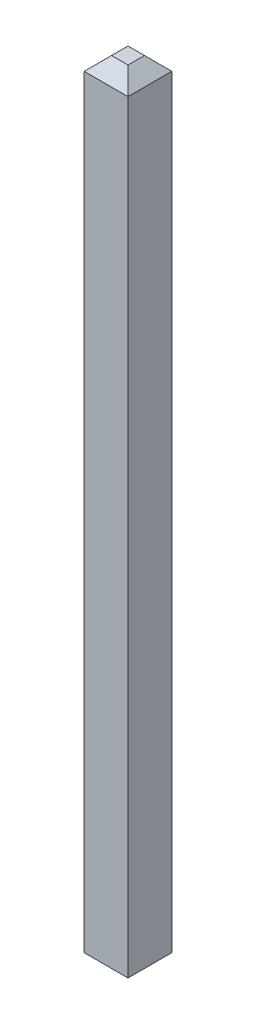
ISO-10303-21;
HEADER;
FILE_DESCRIPTION(('STEP AP214'),'2;1');
FILE_NAME('part.step','',(''),(''),'','','');
FILE_SCHEMA(('AUTOMOTIVE_DESIGN { 1 0 10303 214 1 1 1 1 }'));
ENDSEC;
DATA;
#1=APPLICATION_CONTEXT('core data for automotive mechanical design processes');
#2=APPLICATION_PROTOCOL_DEFINITION('international standard','automotive_design',2000,#1);
#3=PRODUCT_CONTEXT('',#1,'mechanical');
#4=PRODUCT('Part','Part','',(#3));
#5=PRODUCT_RELATED_PRODUCT_CATEGORY('part','',(#4));
#6=PRODUCT_DEFINITION_FORMATION('','',#4);
#7=PRODUCT_DEFINITION_CONTEXT('part definition',#1,'design');
#8=PRODUCT_DEFINITION('design','',#6,#7);
#9=PRODUCT_DEFINITION_SHAPE('','',#8);
#10=(LENGTH_UNIT() NAMED_UNIT(*) SI_UNIT(.MILLI.,.METRE.));
#11=(NAMED_UNIT(*) PLANE_ANGLE_UNIT() SI_UNIT($,.RADIAN.));
#12=(NAMED_UNIT(*) SI_UNIT($,.STERADIAN.) SOLID_ANGLE_UNIT());
#13=UNCERTAINTY_MEASURE_WITH_UNIT(LENGTH_MEASURE(1.E-05),#10,'distance_accuracy_value','');
#14=(GEOMETRIC_REPRESENTATION_CONTEXT(3) GLOBAL_UNCERTAINTY_ASSIGNED_CONTEXT((#13)) GLOBAL_UNIT_ASSIGNED_CONTEXT((#10,
#11,#12)) REPRESENTATION_CONTEXT('',''));
#15=CARTESIAN_POINT('',(0.,0.,0.));
#16=DIRECTION('',(0.,0.,1.));
#17=DIRECTION('',(1.,0.,0.));
#18=AXIS2_PLACEMENT_3D('',#15,#16,#17);
#19=CARTESIAN_POINT('',(4.13,7.07,-0.32));
#20=DIRECTION('',(-0.707106781186548,-0.707106781186548,0.));
#21=DIRECTION('',(-0.707106781186548,0.707106781186548,0.));
#22=AXIS2_PLACEMENT_3D('',#19,#20,#21);
#23=PLANE('',#22);
#24=DIRECTION('',(0.577350269189626,-0.577350269189626,0.577350269189626));
#25=VECTOR('',#24,1.);
#26=CARTESIAN_POINT('',(3.916666666667,7.283333333333,0.106666666667));
#27=LINE('',#26,#25);
#28=CARTESIAN_POINT('',(3.93,7.27,0.12));
#29=VERTEX_POINT('',#28);
#30=CARTESIAN_POINT('',(4.13,7.07,0.32));
#31=VERTEX_POINT('',#30);
#32=EDGE_CURVE('E152',#29,#31,#27,.T.);
#33=ORIENTED_EDGE('',*,*,#32,.T.);
#34=DIRECTION('',(0.,0.,1.));
#35=VECTOR('',#34,1.);
#36=CARTESIAN_POINT('',(4.13,7.07,-0.32));
#37=LINE('',#36,#35);
#38=CARTESIAN_POINT('',(4.13,7.07,-0.32));
#39=VERTEX_POINT('',#38);
#40=EDGE_CURVE('E198',#39,#31,#37,.T.);
#41=ORIENTED_EDGE('',*,*,#40,.F.);
#42=DIRECTION('',(0.577350269189626,-0.577350269189626,-0.577350269189626));
#43=VECTOR('',#42,1.);
#44=CARTESIAN_POINT('',(4.13,7.07,-0.32));
#45=LINE('',#44,#43);
#46=CARTESIAN_POINT('',(3.93,7.27,-0.12));
#47=VERTEX_POINT('',#46);
#48=EDGE_CURVE('E11',#47,#39,#45,.T.);
#49=ORIENTED_EDGE('',*,*,#48,.F.);
#50=DIRECTION('',(0.,0.,-1.));
#51=VECTOR('',#50,1.);
#52=CARTESIAN_POINT('',(3.93,7.27,-0.32));
#53=LINE('',#52,#51);
#54=EDGE_CURVE('E163',#29,#47,#53,.T.);
#55=ORIENTED_EDGE('',*,*,#54,.F.);
#56=EDGE_LOOP('',(#33,#41,#49,#55));
#57=FACE_BOUND('',#56,.T.);
#58=ADVANCED_FACE('F17',(#57),#23,.F.);
#59=CARTESIAN_POINT('',(3.81,7.07,-0.32));
#60=DIRECTION('',(0.,0.707106781186548,-0.707106781186548));
#61=DIRECTION('',(-1.,0.,0.));
#62=AXIS2_PLACEMENT_3D('',#59,#60,#61);
#63=PLANE('',#62);
#64=DIRECTION('',(0.577350269189626,0.577350269189626,0.577350269189626));
#65=VECTOR('',#64,1.);
#66=CARTESIAN_POINT('',(3.623333333333,7.203333333333,-0.186666666667));
#67=LINE('',#66,#65);
#68=CARTESIAN_POINT('',(3.49,7.07,-0.32));
#69=VERTEX_POINT('',#68);
#70=CARTESIAN_POINT('',(3.69,7.27,-0.12));
#71=VERTEX_POINT('',#70);
#72=EDGE_CURVE('E25',#69,#71,#67,.T.);
#73=ORIENTED_EDGE('',*,*,#72,.T.);
#74=DIRECTION('',(-1.,0.,0.));
#75=VECTOR('',#74,1.);
#76=CARTESIAN_POINT('',(3.49,7.27,-0.12));
#77=LINE('',#76,#75);
#78=EDGE_CURVE('E158',#47,#71,#77,.T.);
#79=ORIENTED_EDGE('',*,*,#78,.F.);
#80=ORIENTED_EDGE('',*,*,#48,.T.);
#81=DIRECTION('',(1.,0.,0.));
#82=VECTOR('',#81,1.);
#83=CARTESIAN_POINT('',(4.13,7.07,-0.32));
#84=LINE('',#83,#82);
#85=EDGE_CURVE('E147',#69,#39,#84,.T.);
#86=ORIENTED_EDGE('',*,*,#85,.F.);
#87=EDGE_LOOP('',(#73,#79,#80,#86));
#88=FACE_BOUND('',#87,.T.);
#89=ADVANCED_FACE('F313',(#88),#63,.T.);
#90=CARTESIAN_POINT('',(3.69,7.27,-0.32));
#91=DIRECTION('',(0.707106781186548,-0.707106781186548,0.));
#92=DIRECTION('',(0.,0.,-1.));
#93=AXIS2_PLACEMENT_3D('',#90,#91,#92);
#94=PLANE('',#93);
#95=DIRECTION('',(-0.577350269189626,-0.577350269189626,0.577350269189626));
#96=VECTOR('',#95,1.);
#97=CARTESIAN_POINT('',(3.623333333333,7.203333333333,0.186666666667));
#98=LINE('',#97,#96);
#99=CARTESIAN_POINT('',(3.69,7.27,0.12));
#100=VERTEX_POINT('',#99);
#101=CARTESIAN_POINT('',(3.49,7.07,0.32));
#102=VERTEX_POINT('',#101);
#103=EDGE_CURVE('E37',#100,#102,#98,.T.);
#104=ORIENTED_EDGE('',*,*,#103,.F.);
#105=DIRECTION('',(0.,0.,1.));
#106=VECTOR('',#105,1.);
#107=CARTESIAN_POINT('',(3.69,7.27,-0.32));
#108=LINE('',#107,#106);
#109=EDGE_CURVE('E162',#71,#100,#108,.T.);
#110=ORIENTED_EDGE('',*,*,#109,.F.);
#111=ORIENTED_EDGE('',*,*,#72,.F.);
#112=DIRECTION('',(0.,0.,-1.));
#113=VECTOR('',#112,1.);
#114=CARTESIAN_POINT('',(3.49,7.07,-0.32));
#115=LINE('',#114,#113);
#116=EDGE_CURVE('E174',#102,#69,#115,.T.);
#117=ORIENTED_EDGE('',*,*,#116,.F.);
#118=EDGE_LOOP('',(#104,#110,#111,#117));
#119=FACE_BOUND('',#118,.T.);
#120=ADVANCED_FACE('F309',(#119),#94,.F.);
#121=CARTESIAN_POINT('',(3.49,7.27,0.12));
#122=DIRECTION('',(0.,-0.707106781186548,-0.707106781186548));
#123=DIRECTION('',(0.,-0.707106781186548,0.707106781186548));
#124=AXIS2_PLACEMENT_3D('',#121,#122,#123);
#125=PLANE('',#124);
#126=ORIENTED_EDGE('',*,*,#32,.F.);
#127=DIRECTION('',(1.,0.,0.));
#128=VECTOR('',#127,1.);
#129=CARTESIAN_POINT('',(3.49,7.27,0.12));
#130=LINE('',#129,#128);
#131=EDGE_CURVE('E154',#100,#29,#130,.T.);
#132=ORIENTED_EDGE('',*,*,#131,.F.);
#133=ORIENTED_EDGE('',*,*,#103,.T.);
#134=DIRECTION('',(-1.,0.,0.));
#135=VECTOR('',#134,1.);
#136=CARTESIAN_POINT('',(3.81,7.07,0.32));
#137=LINE('',#136,#135);
#138=EDGE_CURVE('E194',#31,#102,#137,.T.);
#139=ORIENTED_EDGE('',*,*,#138,.F.);
#140=EDGE_LOOP('',(#126,#132,#133,#139));
#141=FACE_BOUND('',#140,.T.);
#142=ADVANCED_FACE('F342',(#141),#125,.F.);
#143=CARTESIAN_POINT('',(3.49,7.27,-0.32));
#144=DIRECTION('',(0.,-1.,0.));
#145=DIRECTION('',(0.,0.,-1.));
#146=AXIS2_PLACEMENT_3D('',#143,#144,#145);
#147=PLANE('',#146);
#148=ORIENTED_EDGE('',*,*,#54,.T.);
#149=ORIENTED_EDGE('',*,*,#78,.T.);
#150=ORIENTED_EDGE('',*,*,#109,.T.);
#151=ORIENTED_EDGE('',*,*,#131,.T.);
#152=EDGE_LOOP('',(#148,#149,#150,#151));
#153=FACE_BOUND('',#152,.T.);
#154=ADVANCED_FACE('F311',(#153),#147,.F.);
#155=CARTESIAN_POINT('',(4.13,7.27,-0.32));
#156=DIRECTION('',(-1.,0.,0.));
#157=DIRECTION('',(0.,1.,0.));
#158=AXIS2_PLACEMENT_3D('',#155,#156,#157);
#159=PLANE('',#158);
#160=DIRECTION('',(0.,-1.,0.));
#161=VECTOR('',#160,1.);
#162=CARTESIAN_POINT('',(4.13,7.27,-0.32));
#163=LINE('',#162,#161);
#164=CARTESIAN_POINT('',(4.13,-4.07,-0.32));
#165=VERTEX_POINT('',#164);
#166=EDGE_CURVE('E143',#39,#165,#163,.T.);
#167=ORIENTED_EDGE('',*,*,#166,.F.);
#168=ORIENTED_EDGE('',*,*,#40,.T.);
#169=DIRECTION('',(0.,-1.,0.));
#170=VECTOR('',#169,1.);
#171=CARTESIAN_POINT('',(4.13,7.27,0.32));
#172=LINE('',#171,#170);
#173=CARTESIAN_POINT('',(4.13,-4.07,0.32));
#174=VERTEX_POINT('',#173);
#175=EDGE_CURVE('E191',#31,#174,#172,.T.);
#176=ORIENTED_EDGE('',*,*,#175,.T.);
#177=DIRECTION('',(0.,0.,-1.));
#178=VECTOR('',#177,1.);
#179=CARTESIAN_POINT('',(4.13,-4.07,-0.32));
#180=LINE('',#179,#178);
#181=EDGE_CURVE('E188',#174,#165,#180,.T.);
#182=ORIENTED_EDGE('',*,*,#181,.T.);
#183=EDGE_LOOP('',(#167,#168,#176,#182));
#184=FACE_BOUND('',#183,.T.);
#185=ADVANCED_FACE('F318',(#184),#159,.F.);
#186=CARTESIAN_POINT('',(3.81,1.5,0.32));
#187=DIRECTION('',(0.,0.,-1.));
#188=DIRECTION('',(0.,-1.,0.));
#189=AXIS2_PLACEMENT_3D('',#186,#187,#188);
#190=PLANE('',#189);
#191=ORIENTED_EDGE('',*,*,#175,.F.);
#192=ORIENTED_EDGE('',*,*,#138,.T.);
#193=DIRECTION('',(0.,1.,0.));
#194=VECTOR('',#193,1.);
#195=CARTESIAN_POINT('',(3.49,-4.27,0.32));
#196=LINE('',#195,#194);
#197=CARTESIAN_POINT('',(3.49,-4.07,0.32));
#198=VERTEX_POINT('',#197);
#199=EDGE_CURVE('E142',#198,#102,#196,.T.);
#200=ORIENTED_EDGE('',*,*,#199,.F.);
#201=DIRECTION('',(1.,0.,0.));
#202=VECTOR('',#201,1.);
#203=CARTESIAN_POINT('',(3.81,-4.07,0.32));
#204=LINE('',#203,#202);
#205=EDGE_CURVE('E169',#198,#174,#204,.T.);
#206=ORIENTED_EDGE('',*,*,#205,.T.);
#207=EDGE_LOOP('',(#191,#192,#200,#206));
#208=FACE_BOUND('',#207,.T.);
#209=ADVANCED_FACE('F306',(#208),#190,.F.);
#210=CARTESIAN_POINT('',(3.93,-4.27,-0.32));
#211=DIRECTION('',(-0.707106781186548,0.707106781186548,0.));
#212=DIRECTION('',(0.,0.,1.));
#213=AXIS2_PLACEMENT_3D('',#210,#211,#212);
#214=PLANE('',#213);
#215=DIRECTION('',(-0.577350269189626,-0.577350269189626,0.577350269189626));
#216=VECTOR('',#215,1.);
#217=CARTESIAN_POINT('',(3.996666666667,-4.203333333333,-0.186666666667));
#218=LINE('',#217,#216);
#219=CARTESIAN_POINT('',(3.93,-4.27,-0.12));
#220=VERTEX_POINT('',#219);
#221=EDGE_CURVE('E104',#165,#220,#218,.T.);
#222=ORIENTED_EDGE('',*,*,#221,.F.);
#223=ORIENTED_EDGE('',*,*,#181,.F.);
#224=DIRECTION('',(-0.577350269189626,-0.577350269189626,-0.577350269189626));
#225=VECTOR('',#224,1.);
#226=CARTESIAN_POINT('',(3.783333333333,-4.416666666667,-0.02666666666667));
#227=LINE('',#226,#225);
#228=CARTESIAN_POINT('',(3.93,-4.27,0.12));
#229=VERTEX_POINT('',#228);
#230=EDGE_CURVE('E130',#174,#229,#227,.T.);
#231=ORIENTED_EDGE('',*,*,#230,.T.);
#232=DIRECTION('',(0.,0.,1.));
#233=VECTOR('',#232,1.);
#234=CARTESIAN_POINT('',(3.93,-4.27,-0.32));
#235=LINE('',#234,#233);
#236=EDGE_CURVE('E122',#220,#229,#235,.T.);
#237=ORIENTED_EDGE('',*,*,#236,.F.);
#238=EDGE_LOOP('',(#222,#223,#231,#237));
#239=FACE_BOUND('',#238,.T.);
#240=ADVANCED_FACE('F128',(#239),#214,.F.);
#241=CARTESIAN_POINT('',(4.13,-4.27,0.12));
#242=DIRECTION('',(0.,0.707106781186548,-0.707106781186548));
#243=DIRECTION('',(-1.,0.,0.));
#244=AXIS2_PLACEMENT_3D('',#241,#242,#243);
#245=PLANE('',#244);
#246=ORIENTED_EDGE('',*,*,#230,.F.);
#247=ORIENTED_EDGE('',*,*,#205,.F.);
#248=DIRECTION('',(-0.577350269189626,0.577350269189626,0.577350269189626));
#249=VECTOR('',#248,1.);
#250=CARTESIAN_POINT('',(3.703333333333,-4.283333333333,0.106666666667));
#251=LINE('',#250,#249);
#252=CARTESIAN_POINT('',(3.69,-4.27,0.12));
#253=VERTEX_POINT('',#252);
#254=EDGE_CURVE('E170',#253,#198,#251,.T.);
#255=ORIENTED_EDGE('',*,*,#254,.F.);
#256=DIRECTION('',(-1.,0.,0.));
#257=VECTOR('',#256,1.);
#258=CARTESIAN_POINT('',(4.13,-4.27,0.12));
#259=LINE('',#258,#257);
#260=EDGE_CURVE('E133',#229,#253,#259,.T.);
#261=ORIENTED_EDGE('',*,*,#260,.F.);
#262=EDGE_LOOP('',(#246,#247,#255,#261));
#263=FACE_BOUND('',#262,.T.);
#264=ADVANCED_FACE('F324',(#263),#245,.F.);
#265=CARTESIAN_POINT('',(3.49,-4.07,-0.32));
#266=DIRECTION('',(0.707106781186548,0.707106781186548,0.));
#267=DIRECTION('',(0.,0.,-1.));
#268=AXIS2_PLACEMENT_3D('',#265,#266,#267);
#269=PLANE('',#268);
#270=DIRECTION('',(0.577350269189626,-0.577350269189626,0.577350269189626));
#271=VECTOR('',#270,1.);
#272=CARTESIAN_POINT('',(3.596666666667,-4.176666666667,-0.213333333333));
#273=LINE('',#272,#271);
#274=CARTESIAN_POINT('',(3.49,-4.07,-0.32));
#275=VERTEX_POINT('',#274);
#276=CARTESIAN_POINT('',(3.69,-4.27,-0.12));
#277=VERTEX_POINT('',#276);
#278=EDGE_CURVE('E126',#275,#277,#273,.T.);
#279=ORIENTED_EDGE('',*,*,#278,.T.);
#280=DIRECTION('',(0.,0.,-1.));
#281=VECTOR('',#280,1.);
#282=CARTESIAN_POINT('',(3.69,-4.27,-0.32));
#283=LINE('',#282,#281);
#284=EDGE_CURVE('E124',#253,#277,#283,.T.);
#285=ORIENTED_EDGE('',*,*,#284,.F.);
#286=ORIENTED_EDGE('',*,*,#254,.T.);
#287=DIRECTION('',(0.,0.,1.));
#288=VECTOR('',#287,1.);
#289=CARTESIAN_POINT('',(3.49,-4.07,-0.32));
#290=LINE('',#289,#288);
#291=EDGE_CURVE('E178',#275,#198,#290,.T.);
#292=ORIENTED_EDGE('',*,*,#291,.F.);
#293=EDGE_LOOP('',(#279,#285,#286,#292));
#294=FACE_BOUND('',#293,.T.);
#295=ADVANCED_FACE('F322',(#294),#269,.F.);
#296=CARTESIAN_POINT('',(3.49,-4.27,-0.32));
#297=DIRECTION('',(1.,0.,0.));
#298=DIRECTION('',(0.,0.,1.));
#299=AXIS2_PLACEMENT_3D('',#296,#297,#298);
#300=PLANE('',#299);
#301=ORIENTED_EDGE('',*,*,#199,.T.);
#302=ORIENTED_EDGE('',*,*,#116,.T.);
#303=DIRECTION('',(0.,1.,0.));
#304=VECTOR('',#303,1.);
#305=CARTESIAN_POINT('',(3.49,-4.27,-0.32));
#306=LINE('',#305,#304);
#307=EDGE_CURVE('E116',#275,#69,#306,.T.);
#308=ORIENTED_EDGE('',*,*,#307,.F.);
#309=ORIENTED_EDGE('',*,*,#291,.T.);
#310=EDGE_LOOP('',(#301,#302,#308,#309));
#311=FACE_BOUND('',#310,.T.);
#312=ADVANCED_FACE('F302',(#311),#300,.F.);
#313=CARTESIAN_POINT('',(3.81,1.5,-0.32));
#314=DIRECTION('',(0.,0.,-1.));
#315=DIRECTION('',(0.,-1.,0.));
#316=AXIS2_PLACEMENT_3D('',#313,#314,#315);
#317=PLANE('',#316);
#318=ORIENTED_EDGE('',*,*,#307,.T.);
#319=ORIENTED_EDGE('',*,*,#85,.T.);
#320=ORIENTED_EDGE('',*,*,#166,.T.);
#321=DIRECTION('',(-1.,0.,0.));
#322=VECTOR('',#321,1.);
#323=CARTESIAN_POINT('',(3.49,-4.07,-0.32));
#324=LINE('',#323,#322);
#325=EDGE_CURVE('E111',#165,#275,#324,.T.);
#326=ORIENTED_EDGE('',*,*,#325,.T.);
#327=EDGE_LOOP('',(#318,#319,#320,#326));
#328=FACE_BOUND('',#327,.T.);
#329=ADVANCED_FACE('F320',(#328),#317,.T.);
#330=CARTESIAN_POINT('',(3.81,-4.07,-0.32));
#331=DIRECTION('',(0.,-0.707106781186548,-0.707106781186548));
#332=DIRECTION('',(0.,-0.707106781186548,0.707106781186548));
#333=AXIS2_PLACEMENT_3D('',#330,#331,#332);
#334=PLANE('',#333);
#335=ORIENTED_EDGE('',*,*,#278,.F.);
#336=ORIENTED_EDGE('',*,*,#325,.F.);
#337=ORIENTED_EDGE('',*,*,#221,.T.);
#338=DIRECTION('',(1.,0.,0.));
#339=VECTOR('',#338,1.);
#340=CARTESIAN_POINT('',(4.13,-4.27,-0.12));
#341=LINE('',#340,#339);
#342=EDGE_CURVE('E108',#277,#220,#341,.T.);
#343=ORIENTED_EDGE('',*,*,#342,.F.);
#344=EDGE_LOOP('',(#335,#336,#337,#343));
#345=FACE_BOUND('',#344,.T.);
#346=ADVANCED_FACE('F107',(#345),#334,.T.);
#347=CARTESIAN_POINT('',(4.13,-4.27,-0.32));
#348=DIRECTION('',(0.,1.,0.));
#349=DIRECTION('',(0.,0.,-1.));
#350=AXIS2_PLACEMENT_3D('',#347,#348,#349);
#351=PLANE('',#350);
#352=ORIENTED_EDGE('',*,*,#236,.T.);
#353=ORIENTED_EDGE('',*,*,#260,.T.);
#354=ORIENTED_EDGE('',*,*,#284,.T.);
#355=ORIENTED_EDGE('',*,*,#342,.T.);
#356=EDGE_LOOP('',(#352,#353,#354,#355));
#357=FACE_BOUND('',#356,.T.);
#358=ADVANCED_FACE('F120',(#357),#351,.F.);
#359=CLOSED_SHELL('',(#58,#89,#120,#142,#154,#185,#209,#240,#264,#295,#312,#329,#346,#358));
#360=MANIFOLD_SOLID_BREP('B1',#359);
#361=ADVANCED_BREP_SHAPE_REPRESENTATION('',(#18,#360),#14);
#362=SHAPE_DEFINITION_REPRESENTATION(#9,#361);
ENDSEC;
END-ISO-10303-21;
